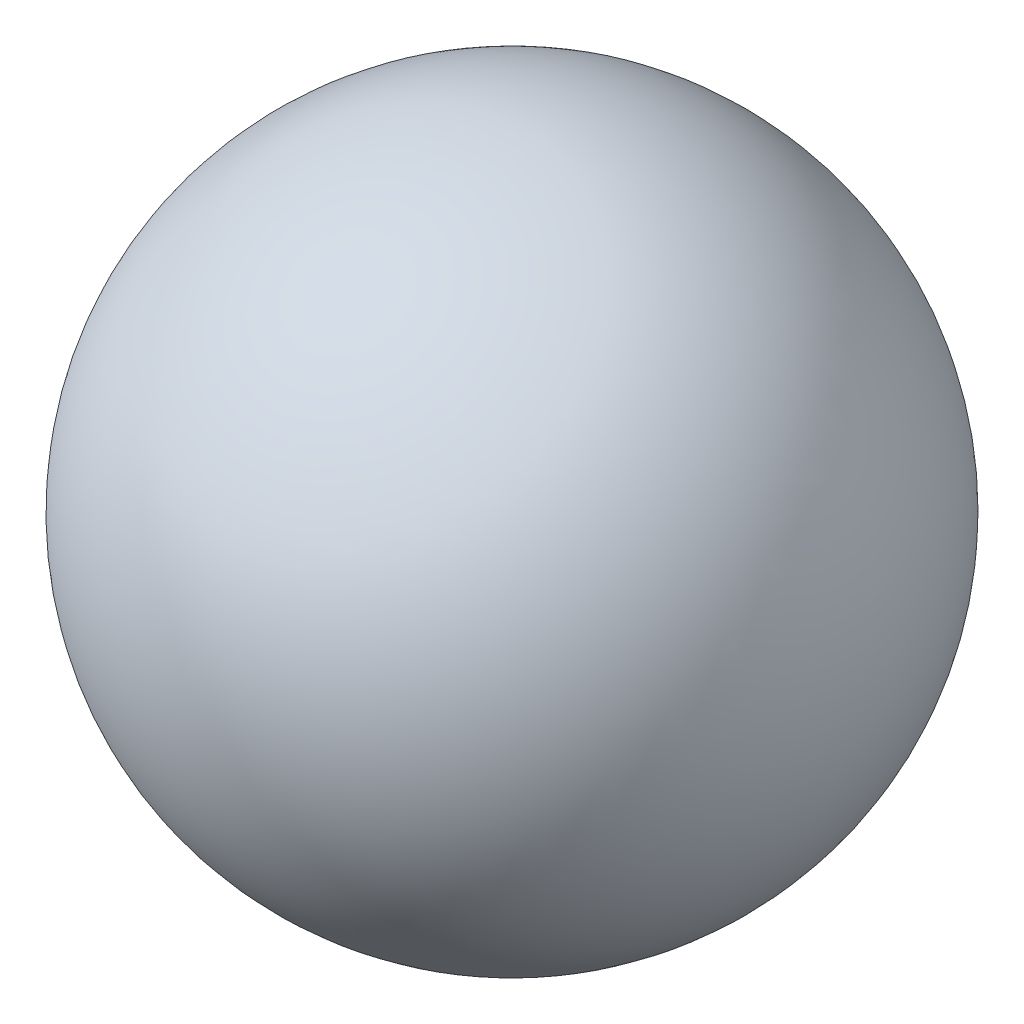
ISO-10303-21;
HEADER;
FILE_DESCRIPTION(('STEP AP214'),'2;1');
FILE_NAME('part.step','',(''),(''),'','','');
FILE_SCHEMA(('AUTOMOTIVE_DESIGN { 1 0 10303 214 1 1 1 1 }'));
ENDSEC;
DATA;
#1=APPLICATION_CONTEXT('core data for automotive mechanical design processes');
#2=APPLICATION_PROTOCOL_DEFINITION('international standard','automotive_design',2000,#1);
#3=PRODUCT_CONTEXT('',#1,'mechanical');
#4=PRODUCT('Part','Part','',(#3));
#5=PRODUCT_RELATED_PRODUCT_CATEGORY('part','',(#4));
#6=PRODUCT_DEFINITION_FORMATION('','',#4);
#7=PRODUCT_DEFINITION_CONTEXT('part definition',#1,'design');
#8=PRODUCT_DEFINITION('design','',#6,#7);
#9=PRODUCT_DEFINITION_SHAPE('','',#8);
#10=(LENGTH_UNIT() NAMED_UNIT(*) SI_UNIT(.MILLI.,.METRE.));
#11=(NAMED_UNIT(*) PLANE_ANGLE_UNIT() SI_UNIT($,.RADIAN.));
#12=(NAMED_UNIT(*) SI_UNIT($,.STERADIAN.) SOLID_ANGLE_UNIT());
#13=UNCERTAINTY_MEASURE_WITH_UNIT(LENGTH_MEASURE(1.E-05),#10,'distance_accuracy_value','');
#14=(GEOMETRIC_REPRESENTATION_CONTEXT(3) GLOBAL_UNCERTAINTY_ASSIGNED_CONTEXT((#13)) GLOBAL_UNIT_ASSIGNED_CONTEXT((#10,
#11,#12)) REPRESENTATION_CONTEXT('',''));
#15=CARTESIAN_POINT('',(0.,0.,0.));
#16=DIRECTION('',(0.,0.,1.));
#17=DIRECTION('',(1.,0.,0.));
#18=AXIS2_PLACEMENT_3D('',#15,#16,#17);
#19=CARTESIAN_POINT('',(0.,0.,0.));
#20=DIRECTION('',(0.,1.,0.));
#21=DIRECTION('',(1.,0.,0.));
#22=AXIS2_PLACEMENT_3D('',#19,#20,#21);
#23=SPHERICAL_SURFACE('',#22,5.);
#24=CARTESIAN_POINT('',(0.,-4.58257569495584,0.));
#25=DIRECTION('',(0.,1.,0.));
#26=DIRECTION('',(0.,0.,1.));
#27=AXIS2_PLACEMENT_3D('',#24,#25,#26);
#28=CIRCLE('',#27,2.);
#29=CARTESIAN_POINT('',(0.,-4.58257569495584,2.));
#30=VERTEX_POINT('',#29);
#31=EDGE_CURVE('E10',#30,#30,#28,.T.);
#32=ORIENTED_EDGE('',*,*,#31,.T.);
#33=EDGE_LOOP('',(#32));
#34=FACE_BOUND('',#33,.T.);
#35=ADVANCED_FACE('F45',(#34),#23,.T.);
#36=CARTESIAN_POINT('',(0.,-5.,0.));
#37=DIRECTION('',(0.,1.,0.));
#38=DIRECTION('',(0.,0.,1.));
#39=AXIS2_PLACEMENT_3D('',#36,#37,#38);
#40=CYLINDRICAL_SURFACE('',#39,2.);
#41=CARTESIAN_POINT('',(0.,0.,0.));
#42=DIRECTION('',(0.,1.,0.));
#43=DIRECTION('',(0.,0.,1.));
#44=AXIS2_PLACEMENT_3D('',#41,#42,#43);
#45=CIRCLE('',#44,2.);
#46=CARTESIAN_POINT('',(0.,0.,2.));
#47=VERTEX_POINT('',#46);
#48=EDGE_CURVE('E52',#47,#47,#45,.T.);
#49=ORIENTED_EDGE('',*,*,#48,.T.);
#50=EDGE_LOOP('',(#49));
#51=FACE_BOUND('',#50,.T.);
#52=ORIENTED_EDGE('',*,*,#31,.F.);
#53=EDGE_LOOP('',(#52));
#54=FACE_BOUND('',#53,.T.);
#55=ADVANCED_FACE('F59',(#51,#54),#40,.F.);
#56=CARTESIAN_POINT('',(0.,0.,0.));
#57=DIRECTION('',(0.,1.,0.));
#58=DIRECTION('',(0.,0.,1.));
#59=AXIS2_PLACEMENT_3D('',#56,#57,#58);
#60=PLANE('',#59);
#61=ORIENTED_EDGE('',*,*,#48,.F.);
#62=EDGE_LOOP('',(#61));
#63=FACE_BOUND('',#62,.T.);
#64=ADVANCED_FACE('F62',(#63),#60,.F.);
#65=CLOSED_SHELL('',(#35,#55,#64));
#66=MANIFOLD_SOLID_BREP('B2',#65);
#67=ADVANCED_BREP_SHAPE_REPRESENTATION('',(#18,#66),#14);
#68=SHAPE_DEFINITION_REPRESENTATION(#9,#67);
ENDSEC;
END-ISO-10303-21;
